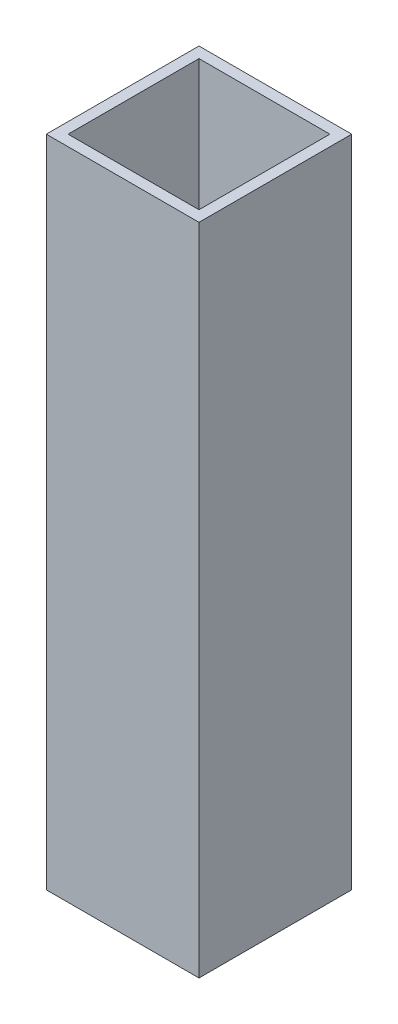
ISO-10303-21;
HEADER;
FILE_DESCRIPTION(('STEP AP214'),'2;1');
FILE_NAME('part.step','',(''),(''),'','','');
FILE_SCHEMA(('AUTOMOTIVE_DESIGN { 1 0 10303 214 1 1 1 1 }'));
ENDSEC;
DATA;
#1=APPLICATION_CONTEXT('core data for automotive mechanical design processes');
#2=APPLICATION_PROTOCOL_DEFINITION('international standard','automotive_design',2000,#1);
#3=PRODUCT_CONTEXT('',#1,'mechanical');
#4=PRODUCT('Part','Part','',(#3));
#5=PRODUCT_RELATED_PRODUCT_CATEGORY('part','',(#4));
#6=PRODUCT_DEFINITION_FORMATION('','',#4);
#7=PRODUCT_DEFINITION_CONTEXT('part definition',#1,'design');
#8=PRODUCT_DEFINITION('design','',#6,#7);
#9=PRODUCT_DEFINITION_SHAPE('','',#8);
#10=(LENGTH_UNIT() NAMED_UNIT(*) SI_UNIT(.MILLI.,.METRE.));
#11=(NAMED_UNIT(*) PLANE_ANGLE_UNIT() SI_UNIT($,.RADIAN.));
#12=(NAMED_UNIT(*) SI_UNIT($,.STERADIAN.) SOLID_ANGLE_UNIT());
#13=UNCERTAINTY_MEASURE_WITH_UNIT(LENGTH_MEASURE(1.E-05),#10,'distance_accuracy_value','');
#14=(GEOMETRIC_REPRESENTATION_CONTEXT(3) GLOBAL_UNCERTAINTY_ASSIGNED_CONTEXT((#13)) GLOBAL_UNIT_ASSIGNED_CONTEXT((#10,
#11,#12)) REPRESENTATION_CONTEXT('',''));
#15=CARTESIAN_POINT('',(0.,0.,0.));
#16=DIRECTION('',(0.,0.,1.));
#17=DIRECTION('',(1.,0.,0.));
#18=AXIS2_PLACEMENT_3D('',#15,#16,#17);
#19=CARTESIAN_POINT('',(22.2249999999998,-95.25,22.225));
#20=DIRECTION('',(0.999999999999995,0.,0.));
#21=DIRECTION('',(0.,0.,-0.999999999999989));
#22=AXIS2_PLACEMENT_3D('',#19,#20,#21);
#23=PLANE('',#22);
#24=DIRECTION('',(0.,0.999999999999995,0.));
#25=VECTOR('',#24,1.);
#26=CARTESIAN_POINT('',(22.2249999999998,-95.25,-22.2250000000001));
#27=LINE('',#26,#25);
#28=CARTESIAN_POINT('',(22.2249999999998,-95.25,-22.2250000000001));
#29=VERTEX_POINT('',#28);
#30=CARTESIAN_POINT('',(22.2249999999998,95.2499999999974,-22.2249999999999));
#31=VERTEX_POINT('',#30);
#32=EDGE_CURVE('E41',#29,#31,#27,.T.);
#33=ORIENTED_EDGE('',*,*,#32,.T.);
#34=DIRECTION('',(0.,0.,-0.999999999999989));
#35=VECTOR('',#34,1.);
#36=CARTESIAN_POINT('',(22.2249999999998,95.2499999999974,22.225));
#37=LINE('',#36,#35);
#38=CARTESIAN_POINT('',(22.2249999999998,95.2499999999974,22.225));
#39=VERTEX_POINT('',#38);
#40=EDGE_CURVE('E140',#39,#31,#37,.T.);
#41=ORIENTED_EDGE('',*,*,#40,.F.);
#42=DIRECTION('',(0.,0.999999999999995,0.));
#43=VECTOR('',#42,1.);
#44=CARTESIAN_POINT('',(22.2249999999998,-95.25,22.225));
#45=LINE('',#44,#43);
#46=CARTESIAN_POINT('',(22.2249999999998,-95.25,22.225));
#47=VERTEX_POINT('',#46);
#48=EDGE_CURVE('E11',#47,#39,#45,.T.);
#49=ORIENTED_EDGE('',*,*,#48,.F.);
#50=DIRECTION('',(0.,0.,-0.999999999999989));
#51=VECTOR('',#50,1.);
#52=CARTESIAN_POINT('',(22.2249999999998,-95.25,22.225));
#53=LINE('',#52,#51);
#54=EDGE_CURVE('E168',#47,#29,#53,.T.);
#55=ORIENTED_EDGE('',*,*,#54,.T.);
#56=EDGE_LOOP('',(#33,#41,#49,#55));
#57=FACE_BOUND('',#56,.T.);
#58=ADVANCED_FACE('F38',(#57),#23,.T.);
#59=CARTESIAN_POINT('',(-22.2249999999998,-95.25,22.225));
#60=DIRECTION('',(0.,0.,0.999999999999989));
#61=DIRECTION('',(0.999999999999995,0.,0.));
#62=AXIS2_PLACEMENT_3D('',#59,#60,#61);
#63=PLANE('',#62);
#64=ORIENTED_EDGE('',*,*,#48,.T.);
#65=DIRECTION('',(0.999999999999995,0.,0.));
#66=VECTOR('',#65,1.);
#67=CARTESIAN_POINT('',(-22.2249999999998,95.2499999999974,22.225));
#68=LINE('',#67,#66);
#69=CARTESIAN_POINT('',(-22.2249999999998,95.2499999999974,22.225));
#70=VERTEX_POINT('',#69);
#71=EDGE_CURVE('E152',#70,#39,#68,.T.);
#72=ORIENTED_EDGE('',*,*,#71,.F.);
#73=DIRECTION('',(0.,0.999999999999995,0.));
#74=VECTOR('',#73,1.);
#75=CARTESIAN_POINT('',(-22.2249999999998,-95.25,22.225));
#76=LINE('',#75,#74);
#77=CARTESIAN_POINT('',(-22.2249999999998,-95.25,22.225));
#78=VERTEX_POINT('',#77);
#79=EDGE_CURVE('E47',#78,#70,#76,.T.);
#80=ORIENTED_EDGE('',*,*,#79,.F.);
#81=DIRECTION('',(0.999999999999995,0.,0.));
#82=VECTOR('',#81,1.);
#83=CARTESIAN_POINT('',(-22.2249999999998,-95.25,22.225));
#84=LINE('',#83,#82);
#85=EDGE_CURVE('E184',#78,#47,#84,.T.);
#86=ORIENTED_EDGE('',*,*,#85,.T.);
#87=EDGE_LOOP('',(#64,#72,#80,#86));
#88=FACE_BOUND('',#87,.T.);
#89=ADVANCED_FACE('F202',(#88),#63,.T.);
#90=CARTESIAN_POINT('',(-22.2249999999998,-95.25,22.225));
#91=DIRECTION('',(-0.999999999999995,0.,0.));
#92=DIRECTION('',(0.,0.,0.999999999999989));
#93=AXIS2_PLACEMENT_3D('',#90,#91,#92);
#94=PLANE('',#93);
#95=ORIENTED_EDGE('',*,*,#79,.T.);
#96=DIRECTION('',(0.,0.,0.999999999999989));
#97=VECTOR('',#96,1.);
#98=CARTESIAN_POINT('',(-22.2249999999998,95.2499999999974,22.225));
#99=LINE('',#98,#97);
#100=CARTESIAN_POINT('',(-22.2249999999998,95.2499999999974,-22.2250000000001));
#101=VERTEX_POINT('',#100);
#102=EDGE_CURVE('E148',#101,#70,#99,.T.);
#103=ORIENTED_EDGE('',*,*,#102,.F.);
#104=DIRECTION('',(0.,0.999999999999995,0.));
#105=VECTOR('',#104,1.);
#106=CARTESIAN_POINT('',(-22.2249999999998,-95.25,-22.2250000000001));
#107=LINE('',#106,#105);
#108=CARTESIAN_POINT('',(-22.2249999999998,-95.25,-22.2250000000001));
#109=VERTEX_POINT('',#108);
#110=EDGE_CURVE('E189',#109,#101,#107,.T.);
#111=ORIENTED_EDGE('',*,*,#110,.F.);
#112=DIRECTION('',(0.,0.,0.999999999999989));
#113=VECTOR('',#112,1.);
#114=CARTESIAN_POINT('',(-22.2249999999998,-95.25,22.225));
#115=LINE('',#114,#113);
#116=EDGE_CURVE('E180',#109,#78,#115,.T.);
#117=ORIENTED_EDGE('',*,*,#116,.T.);
#118=EDGE_LOOP('',(#95,#103,#111,#117));
#119=FACE_BOUND('',#118,.T.);
#120=ADVANCED_FACE('F208',(#119),#94,.T.);
#121=CARTESIAN_POINT('',(-22.2249999999998,-95.25,-22.2250000000001));
#122=DIRECTION('',(0.,0.,-0.999999999999989));
#123=DIRECTION('',(-0.999999999999995,0.,0.));
#124=AXIS2_PLACEMENT_3D('',#121,#122,#123);
#125=PLANE('',#124);
#126=ORIENTED_EDGE('',*,*,#110,.T.);
#127=DIRECTION('',(-0.999999999999995,0.,0.));
#128=VECTOR('',#127,1.);
#129=CARTESIAN_POINT('',(-22.2249999999998,95.2499999999974,-22.2250000000001));
#130=LINE('',#129,#128);
#131=EDGE_CURVE('E144',#31,#101,#130,.T.);
#132=ORIENTED_EDGE('',*,*,#131,.F.);
#133=ORIENTED_EDGE('',*,*,#32,.F.);
#134=DIRECTION('',(-0.999999999999995,0.,0.));
#135=VECTOR('',#134,1.);
#136=CARTESIAN_POINT('',(-22.2249999999998,-95.25,-22.2250000000001));
#137=LINE('',#136,#135);
#138=EDGE_CURVE('E176',#29,#109,#137,.T.);
#139=ORIENTED_EDGE('',*,*,#138,.T.);
#140=EDGE_LOOP('',(#126,#132,#133,#139));
#141=FACE_BOUND('',#140,.T.);
#142=ADVANCED_FACE('F197',(#141),#125,.T.);
#143=CARTESIAN_POINT('',(0.,-95.25,0.));
#144=DIRECTION('',(0.,-0.999999999999995,0.));
#145=DIRECTION('',(0.,0.,-0.999999999999989));
#146=AXIS2_PLACEMENT_3D('',#143,#144,#145);
#147=PLANE('',#146);
#148=DIRECTION('',(0.,0.,-0.999999999999989));
#149=VECTOR('',#148,1.);
#150=CARTESIAN_POINT('',(19.0499999999998,-95.25,19.05));
#151=LINE('',#150,#149);
#152=CARTESIAN_POINT('',(19.0499999999998,-95.25,19.05));
#153=VERTEX_POINT('',#152);
#154=CARTESIAN_POINT('',(19.0499999999998,-95.25,-19.05));
#155=VERTEX_POINT('',#154);
#156=EDGE_CURVE('E156',#153,#155,#151,.T.);
#157=ORIENTED_EDGE('',*,*,#156,.T.);
#158=DIRECTION('',(-0.999999999999995,0.,0.));
#159=VECTOR('',#158,1.);
#160=CARTESIAN_POINT('',(-19.0499999999998,-95.25,-19.05));
#161=LINE('',#160,#159);
#162=CARTESIAN_POINT('',(-19.0499999999998,-95.25,-19.05));
#163=VERTEX_POINT('',#162);
#164=EDGE_CURVE('E111',#155,#163,#161,.T.);
#165=ORIENTED_EDGE('',*,*,#164,.T.);
#166=DIRECTION('',(0.,0.,0.999999999999989));
#167=VECTOR('',#166,1.);
#168=CARTESIAN_POINT('',(-19.0499999999998,-95.25,19.05));
#169=LINE('',#168,#167);
#170=CARTESIAN_POINT('',(-19.0499999999998,-95.25,19.05));
#171=VERTEX_POINT('',#170);
#172=EDGE_CURVE('E55',#163,#171,#169,.T.);
#173=ORIENTED_EDGE('',*,*,#172,.T.);
#174=DIRECTION('',(0.999999999999995,0.,0.));
#175=VECTOR('',#174,1.);
#176=CARTESIAN_POINT('',(-19.0499999999998,-95.25,19.05));
#177=LINE('',#176,#175);
#178=EDGE_CURVE('E117',#171,#153,#177,.T.);
#179=ORIENTED_EDGE('',*,*,#178,.T.);
#180=EDGE_LOOP('',(#157,#165,#173,#179));
#181=FACE_BOUND('',#180,.T.);
#182=ORIENTED_EDGE('',*,*,#54,.F.);
#183=ORIENTED_EDGE('',*,*,#85,.F.);
#184=ORIENTED_EDGE('',*,*,#116,.F.);
#185=ORIENTED_EDGE('',*,*,#138,.F.);
#186=EDGE_LOOP('',(#182,#183,#184,#185));
#187=FACE_BOUND('',#186,.T.);
#188=ADVANCED_FACE('F206',(#181,#187),#147,.T.);
#189=CARTESIAN_POINT('',(19.0499999999998,-95.25,19.05));
#190=DIRECTION('',(0.999999999999995,0.,0.));
#191=DIRECTION('',(0.,0.,-0.999999999999989));
#192=AXIS2_PLACEMENT_3D('',#189,#190,#191);
#193=PLANE('',#192);
#194=DIRECTION('',(0.,0.999999999999995,0.));
#195=VECTOR('',#194,1.);
#196=CARTESIAN_POINT('',(19.0499999999998,-95.25,19.05));
#197=LINE('',#196,#195);
#198=CARTESIAN_POINT('',(19.0499999999998,95.2499999999974,19.05));
#199=VERTEX_POINT('',#198);
#200=EDGE_CURVE('E122',#153,#199,#197,.T.);
#201=ORIENTED_EDGE('',*,*,#200,.T.);
#202=DIRECTION('',(0.,0.,-0.999999999999989));
#203=VECTOR('',#202,1.);
#204=CARTESIAN_POINT('',(19.0499999999998,95.2499999999974,19.05));
#205=LINE('',#204,#203);
#206=CARTESIAN_POINT('',(19.0499999999998,95.2499999999974,-19.05));
#207=VERTEX_POINT('',#206);
#208=EDGE_CURVE('E120',#199,#207,#205,.T.);
#209=ORIENTED_EDGE('',*,*,#208,.T.);
#210=DIRECTION('',(0.,0.999999999999995,0.));
#211=VECTOR('',#210,1.);
#212=CARTESIAN_POINT('',(19.0499999999998,-95.25,-19.05));
#213=LINE('',#212,#211);
#214=EDGE_CURVE('E104',#155,#207,#213,.T.);
#215=ORIENTED_EDGE('',*,*,#214,.F.);
#216=ORIENTED_EDGE('',*,*,#156,.F.);
#217=EDGE_LOOP('',(#201,#209,#215,#216));
#218=FACE_BOUND('',#217,.T.);
#219=ADVANCED_FACE('F121',(#218),#193,.F.);
#220=CARTESIAN_POINT('',(-19.0499999999998,-95.25,19.05));
#221=DIRECTION('',(0.,0.,0.999999999999989));
#222=DIRECTION('',(0.999999999999995,0.,0.));
#223=AXIS2_PLACEMENT_3D('',#220,#221,#222);
#224=PLANE('',#223);
#225=DIRECTION('',(0.,0.999999999999995,0.));
#226=VECTOR('',#225,1.);
#227=CARTESIAN_POINT('',(-19.0499999999998,-95.25,19.05));
#228=LINE('',#227,#226);
#229=CARTESIAN_POINT('',(-19.0499999999998,95.2499999999974,19.05));
#230=VERTEX_POINT('',#229);
#231=EDGE_CURVE('E169',#171,#230,#228,.T.);
#232=ORIENTED_EDGE('',*,*,#231,.T.);
#233=DIRECTION('',(0.999999999999995,0.,0.));
#234=VECTOR('',#233,1.);
#235=CARTESIAN_POINT('',(-19.0499999999998,95.2499999999974,19.05));
#236=LINE('',#235,#234);
#237=EDGE_CURVE('E135',#230,#199,#236,.T.);
#238=ORIENTED_EDGE('',*,*,#237,.T.);
#239=ORIENTED_EDGE('',*,*,#200,.F.);
#240=ORIENTED_EDGE('',*,*,#178,.F.);
#241=EDGE_LOOP('',(#232,#238,#239,#240));
#242=FACE_BOUND('',#241,.T.);
#243=ADVANCED_FACE('F251',(#242),#224,.F.);
#244=CARTESIAN_POINT('',(-19.0499999999998,-95.25,19.05));
#245=DIRECTION('',(-0.999999999999995,0.,0.));
#246=DIRECTION('',(0.,0.,0.999999999999989));
#247=AXIS2_PLACEMENT_3D('',#244,#245,#246);
#248=PLANE('',#247);
#249=DIRECTION('',(0.,0.999999999999995,0.));
#250=VECTOR('',#249,1.);
#251=CARTESIAN_POINT('',(-19.0499999999998,-95.25,-19.05));
#252=LINE('',#251,#250);
#253=CARTESIAN_POINT('',(-19.0499999999998,95.2499999999974,-19.05));
#254=VERTEX_POINT('',#253);
#255=EDGE_CURVE('E116',#163,#254,#252,.T.);
#256=ORIENTED_EDGE('',*,*,#255,.T.);
#257=DIRECTION('',(0.,0.,0.999999999999989));
#258=VECTOR('',#257,1.);
#259=CARTESIAN_POINT('',(-19.0499999999998,95.2499999999974,19.05));
#260=LINE('',#259,#258);
#261=EDGE_CURVE('E130',#254,#230,#260,.T.);
#262=ORIENTED_EDGE('',*,*,#261,.T.);
#263=ORIENTED_EDGE('',*,*,#231,.F.);
#264=ORIENTED_EDGE('',*,*,#172,.F.);
#265=EDGE_LOOP('',(#256,#262,#263,#264));
#266=FACE_BOUND('',#265,.T.);
#267=ADVANCED_FACE('F260',(#266),#248,.F.);
#268=CARTESIAN_POINT('',(-19.0499999999998,-95.25,-19.05));
#269=DIRECTION('',(0.,0.,-0.999999999999989));
#270=DIRECTION('',(-0.999999999999995,0.,0.));
#271=AXIS2_PLACEMENT_3D('',#268,#269,#270);
#272=PLANE('',#271);
#273=ORIENTED_EDGE('',*,*,#214,.T.);
#274=DIRECTION('',(-0.999999999999995,0.,0.));
#275=VECTOR('',#274,1.);
#276=CARTESIAN_POINT('',(-19.0499999999998,95.2499999999974,-19.05));
#277=LINE('',#276,#275);
#278=EDGE_CURVE('E108',#207,#254,#277,.T.);
#279=ORIENTED_EDGE('',*,*,#278,.T.);
#280=ORIENTED_EDGE('',*,*,#255,.F.);
#281=ORIENTED_EDGE('',*,*,#164,.F.);
#282=EDGE_LOOP('',(#273,#279,#280,#281));
#283=FACE_BOUND('',#282,.T.);
#284=ADVANCED_FACE('F106',(#283),#272,.F.);
#285=CARTESIAN_POINT('',(0.,95.2499999999974,0.));
#286=DIRECTION('',(0.,-0.999999999999995,0.));
#287=DIRECTION('',(0.,0.,-0.999999999999989));
#288=AXIS2_PLACEMENT_3D('',#285,#286,#287);
#289=PLANE('',#288);
#290=ORIENTED_EDGE('',*,*,#40,.T.);
#291=ORIENTED_EDGE('',*,*,#131,.T.);
#292=ORIENTED_EDGE('',*,*,#102,.T.);
#293=ORIENTED_EDGE('',*,*,#71,.T.);
#294=EDGE_LOOP('',(#290,#291,#292,#293));
#295=FACE_BOUND('',#294,.T.);
#296=ORIENTED_EDGE('',*,*,#208,.F.);
#297=ORIENTED_EDGE('',*,*,#237,.F.);
#298=ORIENTED_EDGE('',*,*,#261,.F.);
#299=ORIENTED_EDGE('',*,*,#278,.F.);
#300=EDGE_LOOP('',(#296,#297,#298,#299));
#301=FACE_BOUND('',#300,.T.);
#302=ADVANCED_FACE('F128',(#295,#301),#289,.F.);
#303=CLOSED_SHELL('',(#58,#89,#120,#142,#188,#219,#243,#267,#284,#302));
#304=MANIFOLD_SOLID_BREP('B2',#303);
#305=ADVANCED_BREP_SHAPE_REPRESENTATION('',(#18,#304),#14);
#306=SHAPE_DEFINITION_REPRESENTATION(#9,#305);
ENDSEC;
END-ISO-10303-21;
